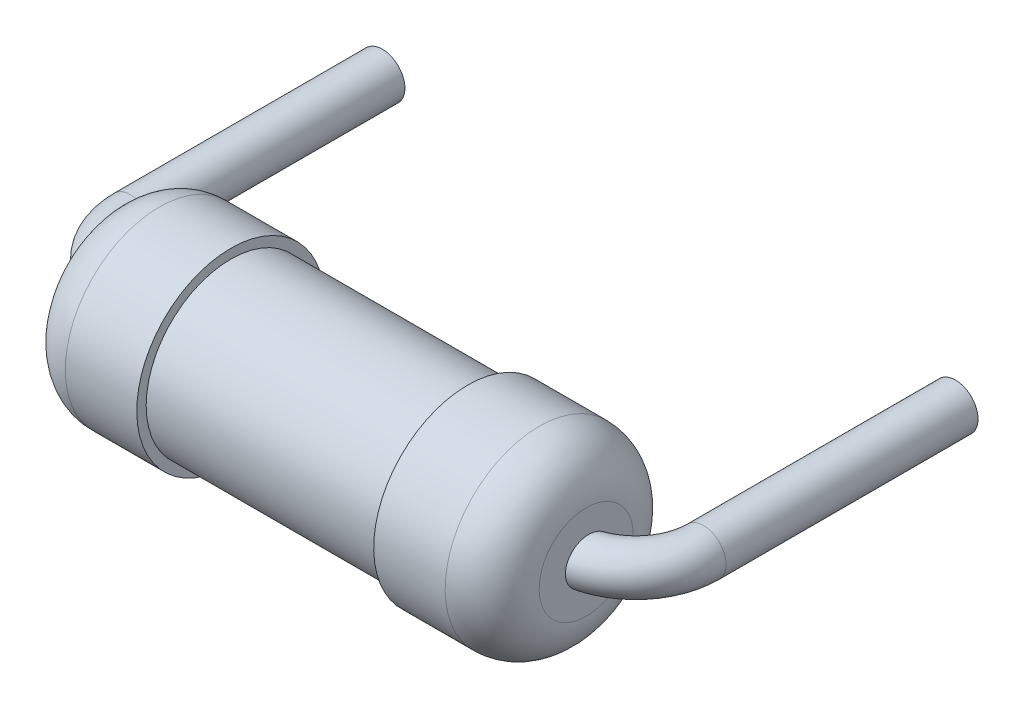
ISO-10303-21;
HEADER;
FILE_DESCRIPTION(('STEP AP214'),'2;1');
FILE_NAME('part.step','',(''),(''),'','','');
FILE_SCHEMA(('AUTOMOTIVE_DESIGN { 1 0 10303 214 1 1 1 1 }'));
ENDSEC;
DATA;
#1=APPLICATION_CONTEXT('core data for automotive mechanical design processes');
#2=APPLICATION_PROTOCOL_DEFINITION('international standard','automotive_design',2000,#1);
#3=PRODUCT_CONTEXT('',#1,'mechanical');
#4=PRODUCT('Part','Part','',(#3));
#5=PRODUCT_RELATED_PRODUCT_CATEGORY('part','',(#4));
#6=PRODUCT_DEFINITION_FORMATION('','',#4);
#7=PRODUCT_DEFINITION_CONTEXT('part definition',#1,'design');
#8=PRODUCT_DEFINITION('design','',#6,#7);
#9=PRODUCT_DEFINITION_SHAPE('','',#8);
#10=(LENGTH_UNIT() NAMED_UNIT(*) SI_UNIT(.MILLI.,.METRE.));
#11=(NAMED_UNIT(*) PLANE_ANGLE_UNIT() SI_UNIT($,.RADIAN.));
#12=(NAMED_UNIT(*) SI_UNIT($,.STERADIAN.) SOLID_ANGLE_UNIT());
#13=UNCERTAINTY_MEASURE_WITH_UNIT(LENGTH_MEASURE(1.E-05),#10,'distance_accuracy_value','');
#14=(GEOMETRIC_REPRESENTATION_CONTEXT(3) GLOBAL_UNCERTAINTY_ASSIGNED_CONTEXT((#13)) GLOBAL_UNIT_ASSIGNED_CONTEXT((#10,
#11,#12)) REPRESENTATION_CONTEXT('',''));
#15=CARTESIAN_POINT('',(0.,0.,0.));
#16=DIRECTION('',(0.,0.,1.));
#17=DIRECTION('',(1.,0.,0.));
#18=AXIS2_PLACEMENT_3D('',#15,#16,#17);
#19=CARTESIAN_POINT('',(7.32,0.,-3.));
#20=DIRECTION('',(0.,0.,1.));
#21=DIRECTION('',(1.,0.,0.));
#22=AXIS2_PLACEMENT_3D('',#19,#20,#21);
#23=PLANE('',#22);
#24=CARTESIAN_POINT('',(7.62,0.,-3.));
#25=DIRECTION('',(0.,0.,-1.));
#26=DIRECTION('',(-1.,0.,0.));
#27=AXIS2_PLACEMENT_3D('',#24,#25,#26);
#28=CIRCLE('',#27,0.3);
#29=CARTESIAN_POINT('',(7.32,0.,-3.));
#30=VERTEX_POINT('',#29);
#31=EDGE_CURVE('E11',#30,#30,#28,.T.);
#32=ORIENTED_EDGE('',*,*,#31,.T.);
#33=EDGE_LOOP('',(#32));
#34=FACE_BOUND('',#33,.T.);
#35=ADVANCED_FACE('F17',(#34),#23,.F.);
#36=CARTESIAN_POINT('',(7.62,0.,0.35));
#37=DIRECTION('',(0.,0.,-1.));
#38=DIRECTION('',(-1.,0.,0.));
#39=AXIS2_PLACEMENT_3D('',#36,#37,#38);
#40=CYLINDRICAL_SURFACE('',#39,0.3);
#41=DIRECTION('',(0.,0.,-1.));
#42=VECTOR('',#41,1.);
#43=CARTESIAN_POINT('',(7.32,0.,0.35));
#44=LINE('',#43,#42);
#45=CARTESIAN_POINT('',(7.32,0.,0.35));
#46=VERTEX_POINT('',#45);
#47=EDGE_CURVE('E25',#46,#30,#44,.T.);
#48=ORIENTED_EDGE('',*,*,#47,.T.);
#49=ORIENTED_EDGE('',*,*,#31,.F.);
#50=ORIENTED_EDGE('',*,*,#47,.F.);
#51=CARTESIAN_POINT('',(7.62,0.,0.35));
#52=DIRECTION('',(0.,0.,1.));
#53=DIRECTION('',(1.,0.,0.));
#54=AXIS2_PLACEMENT_3D('',#51,#52,#53);
#55=CIRCLE('',#54,0.3);
#56=EDGE_CURVE('E157',#46,#46,#55,.T.);
#57=ORIENTED_EDGE('',*,*,#56,.F.);
#58=EDGE_LOOP('',(#48,#49,#50,#57));
#59=FACE_BOUND('',#58,.T.);
#60=ADVANCED_FACE('F161',(#59),#40,.T.);
#61=CARTESIAN_POINT('',(6.72,0.,0.35));
#62=DIRECTION('',(0.,1.,0.));
#63=DIRECTION('',(0.,0.,1.));
#64=AXIS2_PLACEMENT_3D('',#61,#62,#63);
#65=TOROIDAL_SURFACE('',#64,0.9,0.3);
#66=CARTESIAN_POINT('',(6.96,0.,0.899909083395));
#67=CARTESIAN_POINT('',(6.96,-0.009860167462582,0.89990896861));
#68=CARTESIAN_POINT('',(6.96,-0.0196044152314,0.900333777569));
#69=CARTESIAN_POINT('',(6.96,-0.02906856746895,0.901162791225));
#70=CARTESIAN_POINT('',(6.96,-0.03818494668051,0.902337445313));
#71=CARTESIAN_POINT('',(6.96,-0.04697397432956,0.903804960014));
#72=CARTESIAN_POINT('',(6.96,-0.0654122858756,0.907588661461));
#73=CARTESIAN_POINT('',(6.96,-0.07491985816654,0.909985989386));
#74=CARTESIAN_POINT('',(6.96,-0.08408849098391,0.912709553602));
#75=CARTESIAN_POINT('',(6.96,-0.09294310465939,0.915726321464));
#76=CARTESIAN_POINT('',(6.96,-0.10150496885,0.919011549987));
#77=CARTESIAN_POINT('',(6.96,-0.118958221281,0.926453836747));
#78=CARTESIAN_POINT('',(6.96,-0.127787715696,0.930666010737));
#79=CARTESIAN_POINT('',(6.96,-0.136306161655,0.935155928941));
#80=CARTESIAN_POINT('',(6.96,-0.144532121634,0.939904049757));
#81=CARTESIAN_POINT('',(6.96,-0.152479877126,0.944895641374));
#82=CARTESIAN_POINT('',(6.96,-0.168328600516,0.955672815412));
#83=CARTESIAN_POINT('',(6.96,-0.176194773963,0.961488214941));
#84=CARTESIAN_POINT('',(6.96,-0.183772608747,0.967551566344));
#85=CARTESIAN_POINT('',(6.96,-0.191071765541,0.973851742068));
#86=CARTESIAN_POINT('',(6.96,-0.198098606692,0.980379951052));
#87=CARTESIAN_POINT('',(6.96,-0.211800202804,0.994065659178));
#88=CARTESIAN_POINT('',(6.96,-0.218460270558,1.001234983766));
#89=CARTESIAN_POINT('',(6.96,-0.224839910615,1.00863041136));
#90=CARTESIAN_POINT('',(6.96,-0.230940211566,1.016245364777));
#91=CARTESIAN_POINT('',(6.96,-0.236759839456,1.024073990789));
#92=CARTESIAN_POINT('',(6.96,-0.247832003876,1.040150861324));
#93=CARTESIAN_POINT('',(6.96,-0.253084568675,1.048398903269));
#94=CARTESIAN_POINT('',(6.96,-0.258049049185,1.05685004652));
#95=CARTESIAN_POINT('',(6.96,-0.2627200155,1.065498685566));
#96=CARTESIAN_POINT('',(6.96,-0.267090290802,1.074338848812));
#97=CARTESIAN_POINT('',(6.96,-0.275134913375,1.092219064394));
#98=CARTESIAN_POINT('',(6.96,-0.278821000575,1.10125194666));
#99=CARTESIAN_POINT('',(6.96,-0.282200788118,1.110456818481));
#100=CARTESIAN_POINT('',(6.96,-0.285264726102,1.119826534893));
#101=CARTESIAN_POINT('',(6.96,-0.288002139566,1.129352832871));
#102=CARTESIAN_POINT('',(6.96,-0.292725370416,1.148397637921));
#103=CARTESIAN_POINT('',(6.96,-0.29473215882,1.157906911838));
#104=CARTESIAN_POINT('',(6.96,-0.296410834199,1.16754558505));
#105=CARTESIAN_POINT('',(6.96,-0.297750172302,1.177303521997));
#106=CARTESIAN_POINT('',(6.96,-0.298738484134,1.187169019587));
#107=CARTESIAN_POINT('',(6.96,-0.29996489055,1.20670853133));
#108=CARTESIAN_POINT('',(6.96,-0.300230362775,1.216375375657));
#109=CARTESIAN_POINT('',(6.96,-0.300149187552,1.22611747583));
#110=CARTESIAN_POINT('',(6.96,-0.299710732489,1.235921267953));
#111=CARTESIAN_POINT('',(6.96,-0.298904577874,1.245771488577));
#112=CARTESIAN_POINT('',(6.96,-0.296585075031,1.265125180201));
#113=CARTESIAN_POINT('',(6.96,-0.295102319855,1.27462625024));
#114=CARTESIAN_POINT('',(6.96,-0.293263243612,1.284139361954));
#115=CARTESIAN_POINT('',(6.96,-0.29105964956,1.293647958229));
#116=CARTESIAN_POINT('',(6.96,-0.288484151749,1.303133947704));
#117=CARTESIAN_POINT('',(6.96,-0.282698057797,1.321631888118));
#118=CARTESIAN_POINT('',(6.96,-0.279518212828,1.330647292743));
#119=CARTESIAN_POINT('',(6.96,-0.275984865526,1.339606568389));
#120=CARTESIAN_POINT('',(6.96,-0.27209347283,1.348491205415));
#121=CARTESIAN_POINT('',(6.96,-0.26784072321,1.357281534804));
#122=CARTESIAN_POINT('',(6.96,-0.258792456003,1.374285939199));
#123=CARTESIAN_POINT('',(6.96,-0.254025471274,1.382509099941));
#124=CARTESIAN_POINT('',(6.96,-0.248921774536,1.390607746147));
#125=CARTESIAN_POINT('',(6.96,-0.24348099529,1.398562707415));
#126=CARTESIAN_POINT('',(6.96,-0.237704200488,1.406354107177));
#127=CARTESIAN_POINT('',(6.96,-0.225715116467,1.421280374005));
#128=CARTESIAN_POINT('',(6.96,-0.219527700064,1.428429026844));
#129=CARTESIAN_POINT('',(6.96,-0.213033898729,1.435388985848));
#130=CARTESIAN_POINT('',(6.96,-0.206237442407,1.442141620875));
#131=CARTESIAN_POINT('',(6.96,-0.199143537578,1.448668007007));
#132=CARTESIAN_POINT('',(6.96,-0.184639358866,1.461004311837));
#133=CARTESIAN_POINT('',(6.96,-0.177249661366,1.46683162664));
#134=CARTESIAN_POINT('',(6.96,-0.169595743404,1.472413651413));
#135=CARTESIAN_POINT('',(6.96,-0.161685063001,1.477733185029));
#136=CARTESIAN_POINT('',(6.96,-0.153526567552,1.482773042789));
#137=CARTESIAN_POINT('',(6.96,-0.137020377957,1.492097733275));
#138=CARTESIAN_POINT('',(6.96,-0.128688741655,1.496402506097));
#139=CARTESIAN_POINT('',(6.96,-0.120145015698,1.500414870926));
#140=CARTESIAN_POINT('',(6.96,-0.111400273136,1.504119613979));
#141=CARTESIAN_POINT('',(6.96,-0.102467429294,1.507501811642));
#142=CARTESIAN_POINT('',(6.96,-0.08453487359643,1.513498183633));
#143=CARTESIAN_POINT('',(6.96,-0.07554644720911,1.51613308184));
#144=CARTESIAN_POINT('',(6.96,-0.06640854708582,1.518437839156));
#145=CARTESIAN_POINT('',(6.96,-0.05713780068804,1.520399910874));
#146=CARTESIAN_POINT('',(6.96,-0.04775487845774,1.522007893513));
#147=CARTESIAN_POINT('',(6.96,-0.02969292548283,1.52437977876));
#148=CARTESIAN_POINT('',(6.96,-0.02102889094976,1.525208924822));
#149=CARTESIAN_POINT('',(6.96,-0.01231404153143,1.525730890851));
#150=CARTESIAN_POINT('',(6.96,-0.003572679276074,1.525941220805));
#151=CARTESIAN_POINT('',(6.96,0.005168243033088,1.52583907475));
#152=CARTESIAN_POINT('',(6.96,0.02337844678287,1.524978413229));
#153=CARTESIAN_POINT('',(6.96,0.03284373024997,1.524160868463));
#154=CARTESIAN_POINT('',(6.96,0.04224172239025,1.522980299422));
#155=CARTESIAN_POINT('',(6.96,0.05154503802108,1.521444853212));
#156=CARTESIAN_POINT('',(6.96,0.06073215666605,1.519565119195));
#157=CARTESIAN_POINT('',(6.96,0.07909771199475,1.515080715405));
#158=CARTESIAN_POINT('',(6.96,0.0882675531125,1.512456387335));
#159=CARTESIAN_POINT('',(6.96,0.09727920151967,1.509494357792));
#160=CARTESIAN_POINT('',(6.96,0.106117302403,1.506208331254));
#161=CARTESIAN_POINT('',(6.96,0.114768890523,1.502612503667));
#162=CARTESIAN_POINT('',(6.96,0.1319661163,1.494697932395));
#163=CARTESIAN_POINT('',(6.96,0.140497712216,1.490358583428));
#164=CARTESIAN_POINT('',(6.96,0.148806071355,1.485719654426));
#165=CARTESIAN_POINT('',(6.96,0.156880646133,1.480797412311));
#166=CARTESIAN_POINT('',(6.96,0.164712447986,1.475608252032));
#167=CARTESIAN_POINT('',(6.96,0.180151425777,1.46453127229));
#168=CARTESIAN_POINT('',(6.96,0.187739967164,1.45862481836));
#169=CARTESIAN_POINT('',(6.96,0.195051332691,1.452467727028));
#170=CARTESIAN_POINT('',(6.96,0.20207865613,1.446078243141));
#171=CARTESIAN_POINT('',(6.96,0.208816543867,1.439474464151));
#172=CARTESIAN_POINT('',(6.96,0.221953238059,1.425612923524));
#173=CARTESIAN_POINT('',(6.96,0.228328994524,1.418339683896));
#174=CARTESIAN_POINT('',(6.96,0.234383964852,1.410874723556));
#175=CARTESIAN_POINT('',(6.96,0.240115238483,1.403237627432));
#176=CARTESIAN_POINT('',(6.96,0.245521373748,1.395447463058));
#177=CARTESIAN_POINT('',(6.96,0.25588986733,1.379276120213));
#178=CARTESIAN_POINT('',(6.96,0.260825161615,1.370883687614));
#179=CARTESIAN_POINT('',(6.96,0.265408347201,1.362366366749));
#180=CARTESIAN_POINT('',(6.96,0.269640836772,1.353744077057));
#181=CARTESIAN_POINT('',(6.96,0.273525389215,1.345035773446));
#182=CARTESIAN_POINT('',(6.96,0.280757370989,1.327109983642));
#183=CARTESIAN_POINT('',(6.96,0.284074778857,1.317886520225));
#184=CARTESIAN_POINT('',(6.96,0.28702301626,1.308609389122));
#185=CARTESIAN_POINT('',(6.96,0.289607785113,1.29929753334));
#186=CARTESIAN_POINT('',(6.96,0.291835806202,1.289968505808));
#187=CARTESIAN_POINT('',(6.96,0.295674983107,1.270905490066));
#188=CARTESIAN_POINT('',(6.96,0.297255138129,1.261171409814));
#189=CARTESIAN_POINT('',(6.96,0.298464076807,1.251454505978));
#190=CARTESIAN_POINT('',(6.96,0.299311079865,1.241771395371));
#191=CARTESIAN_POINT('',(6.96,0.299805916194,1.232137034265));
#192=CARTESIAN_POINT('',(6.96,0.300118111197,1.212595339038));
#193=CARTESIAN_POINT('',(6.96,0.299906304864,1.202693342182));
#194=CARTESIAN_POINT('',(6.96,0.299334986276,1.192873677979));
#195=CARTESIAN_POINT('',(6.96,0.298415549391,1.183149632812));
#196=CARTESIAN_POINT('',(6.96,0.29715921972,1.173532829284));
#197=CARTESIAN_POINT('',(6.96,0.293937801394,1.154190874));
#198=CARTESIAN_POINT('',(6.96,0.291948588365,1.144474495238));
#199=CARTESIAN_POINT('',(6.96,0.28962167445,1.134895115228));
#200=CARTESIAN_POINT('',(6.96,0.286968474246,1.125462408515));
#201=CARTESIAN_POINT('',(6.96,0.283999557728,1.116184698885));
#202=CARTESIAN_POINT('',(6.96,0.277365720041,1.097719338125));
#203=CARTESIAN_POINT('',(6.96,0.273684735103,1.088540329457));
#204=CARTESIAN_POINT('',(6.96,0.269692170683,1.079539418357));
#205=CARTESIAN_POINT('',(6.96,0.265397023465,1.070723360764));
#206=CARTESIAN_POINT('',(6.96,0.260806811571,1.062098183552));
#207=CARTESIAN_POINT('',(6.96,0.251004219697,1.045163947022));
#208=CARTESIAN_POINT('',(6.96,0.245786411547,1.036858741787));
#209=CARTESIAN_POINT('',(6.96,0.240280395782,1.028758943151));
#210=CARTESIAN_POINT('',(6.96,0.234490304979,1.02087012779));
#211=CARTESIAN_POINT('',(6.96,0.22841815861,1.013198074729));
#212=CARTESIAN_POINT('',(6.96,0.215801547815,0.998407234883));
#213=CARTESIAN_POINT('',(6.96,0.209264913083,0.99128247471));
#214=CARTESIAN_POINT('',(6.96,0.202454000094,0.984380026053));
#215=CARTESIAN_POINT('',(6.96,0.195365961507,0.977706983911));
#216=CARTESIAN_POINT('',(6.96,0.187995061392,0.971271997058));
#217=CARTESIAN_POINT('',(6.96,0.173012837564,0.959175029375));
#218=CARTESIAN_POINT('',(6.96,0.165426529007,0.953492099376));
#219=CARTESIAN_POINT('',(6.96,0.157566437944,0.948044934321));
#220=CARTESIAN_POINT('',(6.96,0.149421373308,0.942845601948));
#221=CARTESIAN_POINT('',(6.96,0.140976264593,0.937909781461));
#222=CARTESIAN_POINT('',(6.96,0.124148131162,0.928975627958));
#223=CARTESIAN_POINT('',(6.96,0.115814071992,0.924934439518));
#224=CARTESIAN_POINT('',(6.96,0.107194037794,0.921149181784));
#225=CARTESIAN_POINT('',(6.96,0.09826937450524,0.917639774974));
#226=CARTESIAN_POINT('',(6.96,0.08901696421491,0.914432828225));
#227=CARTESIAN_POINT('',(6.96,0.06762356037127,0.908046964389));
#228=CARTESIAN_POINT('',(6.96,0.05540377745077,0.905068595899));
#229=CARTESIAN_POINT('',(6.96,0.04253681255711,0.902629529668));
#230=CARTESIAN_POINT('',(6.96,0.02893994360873,0.900849442899));
#231=CARTESIAN_POINT('',(6.96,0.0146772221458,0.899909046356));
#232=CARTESIAN_POINT('',(6.96,0.,0.899909083395));
#233=(BOUNDED_CURVE() B_SPLINE_CURVE(6,(#66,#67,#68,#69,#70,#71,#72,#73,#74,#75,#76,#77,#78,#79,
#80,#81,#82,#83,#84,#85,#86,#87,#88,#89,#90,#91,#92,#93,#94,#95,#96,#97,#98,#99,#100,#101,#102,
#103,#104,#105,#106,#107,#108,#109,#110,#111,#112,#113,#114,#115,#116,#117,#118,#119,#120,#121,
#122,#123,#124,#125,#126,#127,#128,#129,#130,#131,#132,#133,#134,#135,#136,#137,#138,#139,#140,
#141,#142,#143,#144,#145,#146,#147,#148,#149,#150,#151,#152,#153,#154,#155,#156,#157,#158,#159,
#160,#161,#162,#163,#164,#165,#166,#167,#168,#169,#170,#171,#172,#173,#174,#175,#176,#177,#178,
#179,#180,#181,#182,#183,#184,#185,#186,#187,#188,#189,#190,#191,#192,#193,#194,#195,#196,#197,
#198,#199,#200,#201,#202,#203,#204,#205,#206,#207,#208,#209,#210,#211,#212,#213,#214,#215,#216,
#217,#218,#219,#220,#221,#222,#223,#224,#225,#226,#227,#228,#229,#230,#231,#232),.UNSPECIFIED.,
.T.,.F.) B_SPLINE_CURVE_WITH_KNOTS((7,5,5,5,5,5,5,5,5,5,5,5,5,5,5,5,5,5,5,5,5,5,5,5,5,5,5,5,5,5,
5,5,5,7),(0.,0.02522151735631,0.05431626764274,0.08648932873413,0.120698905604,0.15585219498,
0.191016701755,0.225517033144,0.258939642143,0.291086884381,0.32191412294,0.351469698498,
0.379846555914,0.407148198058,0.433469525493,0.458895614127,0.483540398702,0.505898369155,
0.530279933853,0.555348100008,0.581270886766,0.608136607836,0.636034631737,0.665066137875,
0.695331933304,0.726904811218,0.759787311372,0.793856187529,0.828799116201,0.864057997078,
0.898806507422,0.932001552493,0.962545077037,1.),
.UNSPECIFIED.) CURVE() GEOMETRIC_REPRESENTATION_ITEM() RATIONAL_B_SPLINE_CURVE((1.,1.,1.,1.,1.,
1.,1.,1.,1.,1.,1.,1.,1.,1.,1.,1.,1.,1.,1.,1.,1.,1.,1.,1.,1.,1.,1.,1.,1.,1.,1.,1.,1.,1.,1.,1.,1.,
1.,1.,1.,1.,1.,1.,1.,1.,1.,1.,1.,1.,1.,1.,1.,1.,1.,1.,1.,1.,1.,1.,1.,1.,1.,1.,1.,1.,1.,1.,1.,1.,
1.,1.,1.,1.,1.,1.,1.,1.,1.,1.,1.,1.,1.,1.,1.,1.,1.,1.,1.,1.,1.,1.,1.,1.,1.,1.,1.,1.,1.,1.,1.,1.,
1.,1.,1.,1.,1.,1.,1.,1.,1.,1.,1.,1.,1.,1.,1.,1.,1.,1.,1.,1.,1.,1.,1.,1.,1.,1.,1.,1.,1.,1.,1.,1.,
1.,1.,1.,1.,1.,1.,1.,1.,1.,1.,1.,1.,1.,1.,1.,1.,1.,1.,1.,1.,1.,1.,1.,1.,1.,1.,1.,1.,1.,1.,1.,1.,
1.,1.)) REPRESENTATION_ITEM(''));
#234=CARTESIAN_POINT('',(6.96,0.,0.899909083395));
#235=VERTEX_POINT('',#234);
#236=EDGE_CURVE('E129',#235,#235,#233,.T.);
#237=ORIENTED_EDGE('',*,*,#236,.F.);
#238=CARTESIAN_POINT('',(6.72,0.,0.35));
#239=DIRECTION('',(0.,1.,0.));
#240=DIRECTION('',(0.,0.,1.));
#241=AXIS2_PLACEMENT_3D('',#238,#239,#240);
#242=CIRCLE('',#241,0.6);
#243=EDGE_CURVE('E150',#235,#46,#242,.T.);
#244=ORIENTED_EDGE('',*,*,#243,.T.);
#245=ORIENTED_EDGE('',*,*,#56,.T.);
#246=ORIENTED_EDGE('',*,*,#243,.F.);
#247=EDGE_LOOP('',(#237,#244,#245,#246));
#248=FACE_BOUND('',#247,.T.);
#249=ADVANCED_FACE('F164',(#248),#65,.T.);
#250=CARTESIAN_POINT('',(6.96,1.25,1.25));
#251=DIRECTION('',(-1.,0.,0.));
#252=DIRECTION('',(0.,0.,1.));
#253=AXIS2_PLACEMENT_3D('',#250,#251,#252);
#254=PLANE('',#253);
#255=ORIENTED_EDGE('',*,*,#236,.T.);
#256=EDGE_LOOP('',(#255));
#257=FACE_BOUND('',#256,.T.);
#258=CARTESIAN_POINT('',(6.96,0.,1.25));
#259=DIRECTION('',(1.,0.,0.));
#260=DIRECTION('',(0.,1.,0.));
#261=AXIS2_PLACEMENT_3D('',#258,#259,#260);
#262=CIRCLE('',#261,0.625);
#263=CARTESIAN_POINT('',(6.96,0.625,1.25));
#264=VERTEX_POINT('',#263);
#265=EDGE_CURVE('E124',#264,#264,#262,.T.);
#266=ORIENTED_EDGE('',*,*,#265,.T.);
#267=EDGE_LOOP('',(#266));
#268=FACE_BOUND('',#267,.T.);
#269=ADVANCED_FACE('F166',(#257,#268),#254,.F.);
#270=CARTESIAN_POINT('',(6.335,0.,1.25));
#271=DIRECTION('',(1.,0.,0.));
#272=DIRECTION('',(0.,1.,0.));
#273=AXIS2_PLACEMENT_3D('',#270,#271,#272);
#274=DEGENERATE_TOROIDAL_SURFACE('',#273,0.625,0.625,.T.);
#275=CARTESIAN_POINT('',(6.335,0.625,1.25));
#276=DIRECTION('',(0.,0.,-1.));
#277=DIRECTION('',(0.,1.,0.));
#278=AXIS2_PLACEMENT_3D('',#275,#276,#277);
#279=CIRCLE('',#278,0.625);
#280=CARTESIAN_POINT('',(6.335,1.25,1.25));
#281=VERTEX_POINT('',#280);
#282=EDGE_CURVE('E130',#281,#264,#279,.T.);
#283=ORIENTED_EDGE('',*,*,#282,.F.);
#284=CARTESIAN_POINT('',(6.335,0.,1.25));
#285=DIRECTION('',(1.,0.,0.));
#286=DIRECTION('',(0.,1.,0.));
#287=AXIS2_PLACEMENT_3D('',#284,#285,#286);
#288=CIRCLE('',#287,1.25);
#289=EDGE_CURVE('E114',#281,#281,#288,.T.);
#290=ORIENTED_EDGE('',*,*,#289,.T.);
#291=ORIENTED_EDGE('',*,*,#282,.T.);
#292=ORIENTED_EDGE('',*,*,#265,.F.);
#293=EDGE_LOOP('',(#283,#290,#291,#292));
#294=FACE_BOUND('',#293,.T.);
#295=ADVANCED_FACE('F169',(#294),#274,.T.);
#296=CARTESIAN_POINT('',(0.3,0.,-3.));
#297=DIRECTION('',(0.,0.,-1.));
#298=DIRECTION('',(0.,-1.,0.));
#299=AXIS2_PLACEMENT_3D('',#296,#297,#298);
#300=PLANE('',#299);
#301=CARTESIAN_POINT('',(0.,0.,-3.));
#302=DIRECTION('',(0.,0.,1.));
#303=DIRECTION('',(1.,0.,0.));
#304=AXIS2_PLACEMENT_3D('',#301,#302,#303);
#305=CIRCLE('',#304,0.3);
#306=CARTESIAN_POINT('',(0.3,0.,-3.));
#307=VERTEX_POINT('',#306);
#308=EDGE_CURVE('E138',#307,#307,#305,.T.);
#309=ORIENTED_EDGE('',*,*,#308,.F.);
#310=EDGE_LOOP('',(#309));
#311=FACE_BOUND('',#310,.T.);
#312=ADVANCED_FACE('F231',(#311),#300,.T.);
#313=CARTESIAN_POINT('',(5.385,0.,1.25));
#314=DIRECTION('',(-1.,0.,0.));
#315=DIRECTION('',(0.,1.,0.));
#316=AXIS2_PLACEMENT_3D('',#313,#314,#315);
#317=CYLINDRICAL_SURFACE('',#316,1.25);
#318=CARTESIAN_POINT('',(5.385,0.,1.25));
#319=DIRECTION('',(1.,0.,0.));
#320=DIRECTION('',(0.,1.,0.));
#321=AXIS2_PLACEMENT_3D('',#318,#319,#320);
#322=CIRCLE('',#321,1.25);
#323=CARTESIAN_POINT('',(5.385,1.25,1.25));
#324=VERTEX_POINT('',#323);
#325=EDGE_CURVE('E134',#324,#324,#322,.T.);
#326=ORIENTED_EDGE('',*,*,#325,.T.);
#327=DIRECTION('',(1.,0.,0.));
#328=VECTOR('',#327,1.);
#329=CARTESIAN_POINT('',(5.385,1.25,1.25));
#330=LINE('',#329,#328);
#331=EDGE_CURVE('E141',#324,#281,#330,.T.);
#332=ORIENTED_EDGE('',*,*,#331,.T.);
#333=ORIENTED_EDGE('',*,*,#289,.F.);
#334=ORIENTED_EDGE('',*,*,#331,.F.);
#335=EDGE_LOOP('',(#326,#332,#333,#334));
#336=FACE_BOUND('',#335,.T.);
#337=ADVANCED_FACE('F227',(#336),#317,.T.);
#338=CARTESIAN_POINT('',(0.,0.,-3.));
#339=DIRECTION('',(0.,0.,1.));
#340=DIRECTION('',(1.,0.,0.));
#341=AXIS2_PLACEMENT_3D('',#338,#339,#340);
#342=CYLINDRICAL_SURFACE('',#341,0.3);
#343=DIRECTION('',(0.,0.,1.));
#344=VECTOR('',#343,1.);
#345=CARTESIAN_POINT('',(0.3,0.,-3.));
#346=LINE('',#345,#344);
#347=CARTESIAN_POINT('',(0.3,0.,0.35));
#348=VERTEX_POINT('',#347);
#349=EDGE_CURVE('E135',#307,#348,#346,.T.);
#350=ORIENTED_EDGE('',*,*,#349,.T.);
#351=CARTESIAN_POINT('',(0.,0.,0.35));
#352=DIRECTION('',(0.,0.,1.));
#353=DIRECTION('',(1.,0.,0.));
#354=AXIS2_PLACEMENT_3D('',#351,#352,#353);
#355=CIRCLE('',#354,0.3);
#356=EDGE_CURVE('E100',#348,#348,#355,.T.);
#357=ORIENTED_EDGE('',*,*,#356,.F.);
#358=ORIENTED_EDGE('',*,*,#349,.F.);
#359=ORIENTED_EDGE('',*,*,#308,.T.);
#360=EDGE_LOOP('',(#350,#357,#358,#359));
#361=FACE_BOUND('',#360,.T.);
#362=ADVANCED_FACE('F230',(#361),#342,.T.);
#363=CARTESIAN_POINT('',(5.385,1.25,1.25));
#364=DIRECTION('',(-1.,0.,0.));
#365=DIRECTION('',(0.,0.,1.));
#366=AXIS2_PLACEMENT_3D('',#363,#364,#365);
#367=PLANE('',#366);
#368=CARTESIAN_POINT('',(5.385,0.,1.25));
#369=DIRECTION('',(-1.,0.,0.));
#370=DIRECTION('',(0.,1.,0.));
#371=AXIS2_PLACEMENT_3D('',#368,#369,#370);
#372=CIRCLE('',#371,1.125);
#373=CARTESIAN_POINT('',(5.385,1.125,1.25));
#374=VERTEX_POINT('',#373);
#375=EDGE_CURVE('E96',#374,#374,#372,.T.);
#376=ORIENTED_EDGE('',*,*,#375,.F.);
#377=EDGE_LOOP('',(#376));
#378=FACE_BOUND('',#377,.T.);
#379=ORIENTED_EDGE('',*,*,#325,.F.);
#380=EDGE_LOOP('',(#379));
#381=FACE_BOUND('',#380,.T.);
#382=ADVANCED_FACE('F259',(#378,#381),#367,.T.);
#383=CARTESIAN_POINT('',(0.9,0.,0.35));
#384=DIRECTION('',(0.,1.,0.));
#385=DIRECTION('',(-1.,0.,0.));
#386=AXIS2_PLACEMENT_3D('',#383,#384,#385);
#387=TOROIDAL_SURFACE('',#386,0.9,0.3);
#388=ORIENTED_EDGE('',*,*,#356,.T.);
#389=CARTESIAN_POINT('',(0.9,0.,0.35));
#390=DIRECTION('',(0.,1.,0.));
#391=DIRECTION('',(-1.,0.,0.));
#392=AXIS2_PLACEMENT_3D('',#389,#390,#391);
#393=CIRCLE('',#392,0.6);
#394=CARTESIAN_POINT('',(0.66,0.,0.899909083395));
#395=VERTEX_POINT('',#394);
#396=EDGE_CURVE('E107',#348,#395,#393,.T.);
#397=ORIENTED_EDGE('',*,*,#396,.T.);
#398=CARTESIAN_POINT('',(0.66,0.,0.899909083395));
#399=CARTESIAN_POINT('',(0.66,-0.009861963323296,0.899909084471));
#400=CARTESIAN_POINT('',(0.66,-0.01960383099012,0.900333558971));
#401=CARTESIAN_POINT('',(0.66,-0.0290667633729,0.901163095205));
#402=CARTESIAN_POINT('',(0.66,-0.03818473840012,0.902336888075));
#403=CARTESIAN_POINT('',(0.66,-0.04697555886318,0.903805406252));
#404=CARTESIAN_POINT('',(0.66,-0.06541217845247,0.907588617289));
#405=CARTESIAN_POINT('',(0.66,-0.07491989955217,0.909985996381));
#406=CARTESIAN_POINT('',(0.66,-0.08408858685729,0.912709602459));
#407=CARTESIAN_POINT('',(0.66,-0.0929431150905,0.915726339128));
#408=CARTESIAN_POINT('',(0.66,-0.101504886237,0.919011492948));
#409=CARTESIAN_POINT('',(0.66,-0.118958160976,0.926453793498));
#410=CARTESIAN_POINT('',(0.66,-0.127787740677,0.930666021227));
#411=CARTESIAN_POINT('',(0.66,-0.136306213845,0.935155972835));
#412=CARTESIAN_POINT('',(0.66,-0.144532125259,0.939904061777));
#413=CARTESIAN_POINT('',(0.66,-0.152479834979,0.944895594586));
#414=CARTESIAN_POINT('',(0.66,-0.168328675181,0.955672717204));
#415=CARTESIAN_POINT('',(0.66,-0.176194628708,0.961488338811));
#416=CARTESIAN_POINT('',(0.66,-0.183772627725,0.967551590964));
#417=CARTESIAN_POINT('',(0.66,-0.191071921446,0.973851630909));
#418=CARTESIAN_POINT('',(0.66,-0.19809849539,0.980379998969));
#419=CARTESIAN_POINT('',(0.66,-0.211800252103,0.99406561399));
#420=CARTESIAN_POINT('',(0.66,-0.218460183619,1.001235038361));
#421=CARTESIAN_POINT('',(0.66,-0.224839916669,1.008630424477));
#422=CARTESIAN_POINT('',(0.66,-0.230940302033,1.016245317007));
#423=CARTESIAN_POINT('',(0.66,-0.236759778797,1.024074009311));
#424=CARTESIAN_POINT('',(0.66,-0.247832030244,1.040150827903));
#425=CARTESIAN_POINT('',(0.66,-0.253084597548,1.048398894868));
#426=CARTESIAN_POINT('',(0.66,-0.258049056373,1.056850063306));
#427=CARTESIAN_POINT('',(0.66,-0.262719990238,1.065498702059));
#428=CARTESIAN_POINT('',(0.66,-0.267090249501,1.07433884651));
#429=CARTESIAN_POINT('',(0.66,-0.275134936213,1.092219038761));
#430=CARTESIAN_POINT('',(0.66,-0.278821023102,1.101251941956));
#431=CARTESIAN_POINT('',(0.66,-0.282200792082,1.110456832947));
#432=CARTESIAN_POINT('',(0.66,-0.285264705632,1.119826546568));
#433=CARTESIAN_POINT('',(0.66,-0.288002108658,1.129352827713));
#434=CARTESIAN_POINT('',(0.66,-0.29272539517,1.148397615962));
#435=CARTESIAN_POINT('',(0.66,-0.29473218058,1.157906910826));
#436=CARTESIAN_POINT('',(0.66,-0.296410836061,1.167545600214));
#437=CARTESIAN_POINT('',(0.66,-0.297750151594,1.177303530334));
#438=CARTESIAN_POINT('',(0.66,-0.298738455802,1.187169009313));
#439=CARTESIAN_POINT('',(0.66,-0.299964918417,1.206708514181));
#440=CARTESIAN_POINT('',(0.66,-0.300230384291,1.216375379318));
#441=CARTESIAN_POINT('',(0.66,-0.300149186912,1.226117491764));
#442=CARTESIAN_POINT('',(0.66,-0.299710710819,1.235921272022));
#443=CARTESIAN_POINT('',(0.66,-0.298904551758,1.245771471938));
#444=CARTESIAN_POINT('',(0.66,-0.296585103724,1.265125169703));
#445=CARTESIAN_POINT('',(0.66,-0.295102339165,1.274626258325));
#446=CARTESIAN_POINT('',(0.66,-0.293263240337,1.284139377081));
#447=CARTESIAN_POINT('',(0.66,-0.291059628806,1.293647957516));
#448=CARTESIAN_POINT('',(0.66,-0.288484130363,1.303133926208));
#449=CARTESIAN_POINT('',(0.66,-0.282698083788,1.321631884472));
#450=CARTESIAN_POINT('',(0.66,-0.279518227914,1.330647303479));
#451=CARTESIAN_POINT('',(0.66,-0.275984860345,1.33960658093));
#452=CARTESIAN_POINT('',(0.66,-0.272093455342,1.348491200819));
#453=CARTESIAN_POINT('',(0.66,-0.267840708483,1.357281511993));
#454=CARTESIAN_POINT('',(0.66,-0.258792476906,1.374285940745));
#455=CARTESIAN_POINT('',(0.66,-0.254025481533,1.382509111114));
#456=CARTESIAN_POINT('',(0.66,-0.248921768643,1.390607755283));
#457=CARTESIAN_POINT('',(0.66,-0.243480982245,1.398562700734));
#458=CARTESIAN_POINT('',(0.66,-0.237704192262,1.406354086406));
#459=CARTESIAN_POINT('',(0.66,-0.22571513259,1.421280378602));
#460=CARTESIAN_POINT('',(0.66,-0.219527706492,1.428429037341));
#461=CARTESIAN_POINT('',(0.66,-0.213033892817,1.435388992124));
#462=CARTESIAN_POINT('',(0.66,-0.206237433156,1.442141613477));
#463=CARTESIAN_POINT('',(0.66,-0.199143534101,1.448667989237));
#464=CARTESIAN_POINT('',(0.66,-0.184639374507,1.46100431938));
#465=CARTESIAN_POINT('',(0.66,-0.177249666015,1.466831638372));
#466=CARTESIAN_POINT('',(0.66,-0.169595736209,1.472413656662));
#467=CARTESIAN_POINT('',(0.66,-0.161685054894,1.477733175901));
#468=CARTESIAN_POINT('',(0.66,-0.153526567249,1.482773024258));
#469=CARTESIAN_POINT('',(0.66,-0.137020407721,1.492097753386));
#470=CARTESIAN_POINT('',(0.66,-0.128688747003,1.496402530856));
#471=CARTESIAN_POINT('',(0.66,-0.12014499879,1.500414878928));
#472=CARTESIAN_POINT('',(0.66,-0.111400259626,1.504119593216));
#473=CARTESIAN_POINT('',(0.66,-0.102467435485,1.507501774849));
#474=CARTESIAN_POINT('',(0.66,-0.08453493192811,1.513498294635));
#475=CARTESIAN_POINT('',(0.66,-0.07554639694304,1.516132890753));
#476=CARTESIAN_POINT('',(0.66,-0.0664085144705,1.518437847791));
#477=CARTESIAN_POINT('',(0.66,-0.05713783351899,1.520400106432));
#478=CARTESIAN_POINT('',(0.66,-0.04775488525608,1.522007764907));
#479=CARTESIAN_POINT('',(0.66,-0.02969295309097,1.524379864025));
#480=CARTESIAN_POINT('',(0.66,-0.02102888075484,1.525208782901));
#481=CARTESIAN_POINT('',(0.66,-0.01231401679426,1.525730893697));
#482=CARTESIAN_POINT('',(0.66,-0.003572675622322,1.525941364018));
#483=CARTESIAN_POINT('',(0.66,0.005168222805428,1.525838983228));
#484=CARTESIAN_POINT('',(0.66,0.02337847467049,1.524978205181));
#485=CARTESIAN_POINT('',(0.66,0.03284375814827,1.524161190409));
#486=CARTESIAN_POINT('',(0.66,0.04224166817951,1.522980309203));
#487=CARTESIAN_POINT('',(0.66,0.05154498116248,1.52144453626));
#488=CARTESIAN_POINT('',(0.66,0.06073223707979,1.519565307122));
#489=CARTESIAN_POINT('',(0.66,0.07909772773064,1.515080653378));
#490=CARTESIAN_POINT('',(0.66,0.08826753248322,1.512456350085));
#491=CARTESIAN_POINT('',(0.66,0.09727917108862,1.509494369221));
#492=CARTESIAN_POINT('',(0.66,0.106117308319,1.506208374239));
#493=CARTESIAN_POINT('',(0.66,0.114768939441,1.502612541932));
#494=CARTESIAN_POINT('',(0.66,0.131966117695,1.494697909774));
#495=CARTESIAN_POINT('',(0.66,0.140497702999,1.490358571609));
#496=CARTESIAN_POINT('',(0.66,0.148806061897,1.485719660214));
#497=CARTESIAN_POINT('',(0.66,0.156880650792,1.480797427009));
#498=CARTESIAN_POINT('',(0.66,0.164712466725,1.47560826256));
#499=CARTESIAN_POINT('',(0.66,0.180151423764,1.464531255078));
#500=CARTESIAN_POINT('',(0.66,0.187739958872,1.458624810593));
#501=CARTESIAN_POINT('',(0.66,0.195051326582,1.452467732556));
#502=CARTESIAN_POINT('',(0.66,0.202078661493,1.446078253645));
#503=CARTESIAN_POINT('',(0.66,0.208816558921,1.439474469779));
#504=CARTESIAN_POINT('',(0.66,0.221953232148,1.425612904145));
#505=CARTESIAN_POINT('',(0.66,0.228328983313,1.41833967682));
#506=CARTESIAN_POINT('',(0.66,0.234383958936,1.410874731309));
#507=CARTESIAN_POINT('',(0.66,0.240115246881,1.403237638329));
#508=CARTESIAN_POINT('',(0.66,0.245521392347,1.395447466144));
#509=CARTESIAN_POINT('',(0.66,0.255889855564,1.379276097975));
#510=CARTESIAN_POINT('',(0.66,0.260825146013,1.370883681886));
#511=CARTESIAN_POINT('',(0.66,0.265408341569,1.362366377835));
#512=CARTESIAN_POINT('',(0.66,0.269640849736,1.353744088225));
#513=CARTESIAN_POINT('',(0.66,0.273525413156,1.345035772328));
#514=CARTESIAN_POINT('',(0.66,0.280757352367,1.327109961101));
#515=CARTESIAN_POINT('',(0.66,0.284074759274,1.317886517643));
#516=CARTESIAN_POINT('',(0.66,0.287023012024,1.308609403309));
#517=CARTESIAN_POINT('',(0.66,0.289607802772,1.299297542852));
#518=CARTESIAN_POINT('',(0.66,0.291835834134,1.289968498384));
#519=CARTESIAN_POINT('',(0.66,0.295674958709,1.270905470981));
#520=CARTESIAN_POINT('',(0.66,0.297255116553,1.261171411794));
#521=CARTESIAN_POINT('',(0.66,0.298464074992,1.251454521799));
#522=CARTESIAN_POINT('',(0.66,0.299311100714,1.241771401083));
#523=CARTESIAN_POINT('',(0.66,0.299805944827,1.232137019844));
#524=CARTESIAN_POINT('',(0.66,0.30011808361,1.212595326012));
#525=CARTESIAN_POINT('',(0.66,0.299906283631,1.202693348802));
#526=CARTESIAN_POINT('',(0.66,0.299334987113,1.192873693594));
#527=CARTESIAN_POINT('',(0.66,0.298415571185,1.183149633751));
#528=CARTESIAN_POINT('',(0.66,0.297159245916,1.173532809156));
#529=CARTESIAN_POINT('',(0.66,0.293937772017,1.154190866917));
#530=CARTESIAN_POINT('',(0.66,0.291948568133,1.144474505513));
#531=CARTESIAN_POINT('',(0.66,0.289621677512,1.134895129825));
#532=CARTESIAN_POINT('',(0.66,0.286968496105,1.125462405282));
#533=CARTESIAN_POINT('',(0.66,0.283999580964,1.116184674916));
#534=CARTESIAN_POINT('',(0.66,0.277365684897,1.097719334783));
#535=CARTESIAN_POINT('',(0.66,0.273684712853,1.08854034335));
#536=CARTESIAN_POINT('',(0.66,0.269692176119,1.079539433524));
#537=CARTESIAN_POINT('',(0.66,0.265397048483,1.07072335418));
#538=CARTESIAN_POINT('',(0.66,0.260806835513,1.062098154612));
#539=CARTESIAN_POINT('',(0.66,0.251004164416,1.045163946312));
#540=CARTESIAN_POINT('',(0.66,0.245786379559,1.036858764173));
#541=CARTESIAN_POINT('',(0.66,0.240280407048,1.028758964174));
#542=CARTESIAN_POINT('',(0.66,0.234490342534,1.020870115558));
#543=CARTESIAN_POINT('',(0.66,0.228418190257,1.013198030747));
#544=CARTESIAN_POINT('',(0.66,0.215801462132,0.998407266407));
#545=CARTESIAN_POINT('',(0.66,0.209265037039,0.991282398269));
#546=CARTESIAN_POINT('',(0.66,0.202454011648,0.98438004474));
#547=CARTESIAN_POINT('',(0.66,0.195365844133,0.977707070031));
#548=CARTESIAN_POINT('',(0.66,0.187995125017,0.971271927442));
#549=CARTESIAN_POINT('',(0.66,0.173012685338,0.959175110633));
#550=CARTESIAN_POINT('',(0.66,0.165426730288,0.953491920673));
#551=CARTESIAN_POINT('',(0.66,0.157566473117,0.948044968651));
#552=CARTESIAN_POINT('',(0.66,0.149421191466,0.9428457983));
#553=CARTESIAN_POINT('',(0.66,0.140976348171,0.937909629891));
#554=CARTESIAN_POINT('',(0.66,0.124148062588,0.928975570166));
#555=CARTESIAN_POINT('',(0.66,0.115814079383,0.924934455913));
#556=CARTESIAN_POINT('',(0.66,0.107194119667,0.921149233675));
#557=CARTESIAN_POINT('',(0.66,0.09826941158436,0.91763978502));
#558=CARTESIAN_POINT('',(0.66,0.08901687105598,0.914432779149));
#559=CARTESIAN_POINT('',(0.66,0.06762842160337,0.908048369916));
#560=CARTESIAN_POINT('',(0.66,0.05540310162877,0.905067930004));
#561=CARTESIAN_POINT('',(0.66,0.04253150709481,0.902628405907));
#562=CARTESIAN_POINT('',(0.66,0.02893757304003,0.900850137762));
#563=CARTESIAN_POINT('',(0.66,0.01468319780375,0.899909084997));
#564=CARTESIAN_POINT('',(0.66,0.,0.899909083395));
#565=(BOUNDED_CURVE() B_SPLINE_CURVE(6,(#398,#399,#400,#401,#402,#403,#404,#405,#406,#407,#408,
#409,#410,#411,#412,#413,#414,#415,#416,#417,#418,#419,#420,#421,#422,#423,#424,#425,#426,#427,
#428,#429,#430,#431,#432,#433,#434,#435,#436,#437,#438,#439,#440,#441,#442,#443,#444,#445,#446,
#447,#448,#449,#450,#451,#452,#453,#454,#455,#456,#457,#458,#459,#460,#461,#462,#463,#464,#465,
#466,#467,#468,#469,#470,#471,#472,#473,#474,#475,#476,#477,#478,#479,#480,#481,#482,#483,#484,
#485,#486,#487,#488,#489,#490,#491,#492,#493,#494,#495,#496,#497,#498,#499,#500,#501,#502,#503,
#504,#505,#506,#507,#508,#509,#510,#511,#512,#513,#514,#515,#516,#517,#518,#519,#520,#521,#522,
#523,#524,#525,#526,#527,#528,#529,#530,#531,#532,#533,#534,#535,#536,#537,#538,#539,#540,#541,
#542,#543,#544,#545,#546,#547,#548,#549,#550,#551,#552,#553,#554,#555,#556,#557,#558,#559,#560,
#561,#562,#563,#564),.UNSPECIFIED.,.T.,.F.) B_SPLINE_CURVE_WITH_KNOTS((7,5,5,5,5,5,5,5,5,5,5,5,
5,5,5,5,5,5,5,5,5,5,5,5,5,5,5,5,5,5,5,5,5,7),(0.,0.02521870323933,0.05431496394384,
0.08648919549843,0.120700162351,0.155854554579,0.191019956077,0.22552099352,0.258944151729,
0.291091798271,0.321919308947,0.351475044446,0.379851974729,0.407153625953,0.43347490921,
0.458900868731,0.483545347382,0.505902822615,0.530283950565,0.555351989471,0.581274789002,
0.608140584187,0.636038742308,0.665070462617,0.695336577837,0.72690990423,0.759792997252,
0.79386262098,0.828806470397,0.864066503475,0.898816439436,0.932013287381,0.962558356523,1.),
.UNSPECIFIED.) CURVE() GEOMETRIC_REPRESENTATION_ITEM() RATIONAL_B_SPLINE_CURVE((1.,1.,1.,1.,1.,
1.,1.,1.,1.,1.,1.,1.,1.,1.,1.,1.,1.,1.,1.,1.,1.,1.,1.,1.,1.,1.,1.,1.,1.,1.,1.,1.,1.,1.,1.,1.,1.,
1.,1.,1.,1.,1.,1.,1.,1.,1.,1.,1.,1.,1.,1.,1.,1.,1.,1.,1.,1.,1.,1.,1.,1.,1.,1.,1.,1.,1.,1.,1.,1.,
1.,1.,1.,1.,1.,1.,1.,1.,1.,1.,1.,1.,1.,1.,1.,1.,1.,1.,1.,1.,1.,1.,1.,1.,1.,1.,1.,1.,1.,1.,1.,1.,
1.,1.,1.,1.,1.,1.,1.,1.,1.,1.,1.,1.,1.,1.,1.,1.,1.,1.,1.,1.,1.,1.,1.,1.,1.,1.,1.,1.,1.,1.,1.,1.,
1.,1.,1.,1.,1.,1.,1.,1.,1.,1.,1.,1.,1.,1.,1.,1.,1.,1.,1.,1.,1.,1.,1.,1.,1.,1.,1.,1.,1.,1.,1.,1.,
1.,1.)) REPRESENTATION_ITEM(''));
#566=EDGE_CURVE('E110',#395,#395,#565,.T.);
#567=ORIENTED_EDGE('',*,*,#566,.T.);
#568=ORIENTED_EDGE('',*,*,#396,.F.);
#569=EDGE_LOOP('',(#388,#397,#567,#568));
#570=FACE_BOUND('',#569,.T.);
#571=ADVANCED_FACE('F211',(#570),#387,.T.);
#572=CARTESIAN_POINT('',(0.66,0.,1.25));
#573=DIRECTION('',(-1.,0.,0.));
#574=DIRECTION('',(0.,1.,0.));
#575=AXIS2_PLACEMENT_3D('',#572,#573,#574);
#576=CYLINDRICAL_SURFACE('',#575,1.125);
#577=ORIENTED_EDGE('',*,*,#375,.T.);
#578=DIRECTION('',(1.,0.,0.));
#579=VECTOR('',#578,1.);
#580=CARTESIAN_POINT('',(0.66,1.125,1.25));
#581=LINE('',#580,#579);
#582=CARTESIAN_POINT('',(2.235,1.125,1.25));
#583=VERTEX_POINT('',#582);
#584=EDGE_CURVE('E93',#583,#374,#581,.T.);
#585=ORIENTED_EDGE('',*,*,#584,.F.);
#586=CARTESIAN_POINT('',(2.235,0.,1.25));
#587=DIRECTION('',(-1.,0.,0.));
#588=DIRECTION('',(0.,1.,0.));
#589=AXIS2_PLACEMENT_3D('',#586,#587,#588);
#590=CIRCLE('',#589,1.125);
#591=EDGE_CURVE('E98',#583,#583,#590,.T.);
#592=ORIENTED_EDGE('',*,*,#591,.F.);
#593=ORIENTED_EDGE('',*,*,#584,.T.);
#594=EDGE_LOOP('',(#577,#585,#592,#593));
#595=FACE_BOUND('',#594,.T.);
#596=ADVANCED_FACE('F94',(#595),#576,.T.);
#597=CARTESIAN_POINT('',(0.66,1.25,1.25));
#598=DIRECTION('',(-1.,0.,0.));
#599=DIRECTION('',(0.,0.,1.));
#600=AXIS2_PLACEMENT_3D('',#597,#598,#599);
#601=PLANE('',#600);
#602=ORIENTED_EDGE('',*,*,#566,.F.);
#603=EDGE_LOOP('',(#602));
#604=FACE_BOUND('',#603,.T.);
#605=CARTESIAN_POINT('',(0.66,0.,1.25));
#606=DIRECTION('',(1.,0.,0.));
#607=DIRECTION('',(0.,1.,0.));
#608=AXIS2_PLACEMENT_3D('',#605,#606,#607);
#609=CIRCLE('',#608,0.625);
#610=CARTESIAN_POINT('',(0.66,0.625,1.25));
#611=VERTEX_POINT('',#610);
#612=EDGE_CURVE('E118',#611,#611,#609,.T.);
#613=ORIENTED_EDGE('',*,*,#612,.F.);
#614=EDGE_LOOP('',(#613));
#615=FACE_BOUND('',#614,.T.);
#616=ADVANCED_FACE('F198',(#604,#615),#601,.T.);
#617=CARTESIAN_POINT('',(2.235,1.25,1.25));
#618=DIRECTION('',(-1.,0.,0.));
#619=DIRECTION('',(0.,0.,1.));
#620=AXIS2_PLACEMENT_3D('',#617,#618,#619);
#621=PLANE('',#620);
#622=ORIENTED_EDGE('',*,*,#591,.T.);
#623=EDGE_LOOP('',(#622));
#624=FACE_BOUND('',#623,.T.);
#625=CARTESIAN_POINT('',(2.235,0.,1.25));
#626=DIRECTION('',(1.,0.,0.));
#627=DIRECTION('',(0.,1.,0.));
#628=AXIS2_PLACEMENT_3D('',#625,#626,#627);
#629=CIRCLE('',#628,1.25);
#630=CARTESIAN_POINT('',(2.235,1.25,1.25));
#631=VERTEX_POINT('',#630);
#632=EDGE_CURVE('E189',#631,#631,#629,.T.);
#633=ORIENTED_EDGE('',*,*,#632,.T.);
#634=EDGE_LOOP('',(#633));
#635=FACE_BOUND('',#634,.T.);
#636=ADVANCED_FACE('F200',(#624,#635),#621,.F.);
#637=CARTESIAN_POINT('',(1.285,0.,1.25));
#638=DIRECTION('',(-1.,0.,0.));
#639=DIRECTION('',(0.,1.,0.));
#640=AXIS2_PLACEMENT_3D('',#637,#638,#639);
#641=DEGENERATE_TOROIDAL_SURFACE('',#640,0.625,0.625,.T.);
#642=ORIENTED_EDGE('',*,*,#612,.T.);
#643=CARTESIAN_POINT('',(1.285,0.625,1.25));
#644=DIRECTION('',(0.,0.,1.));
#645=DIRECTION('',(0.,1.,0.));
#646=AXIS2_PLACEMENT_3D('',#643,#644,#645);
#647=CIRCLE('',#646,0.625);
#648=CARTESIAN_POINT('',(1.285,1.25,1.25));
#649=VERTEX_POINT('',#648);
#650=EDGE_CURVE('E116',#649,#611,#647,.T.);
#651=ORIENTED_EDGE('',*,*,#650,.F.);
#652=CARTESIAN_POINT('',(1.285,0.,1.25));
#653=DIRECTION('',(1.,0.,0.));
#654=DIRECTION('',(0.,1.,0.));
#655=AXIS2_PLACEMENT_3D('',#652,#653,#654);
#656=CIRCLE('',#655,1.25);
#657=EDGE_CURVE('E243',#649,#649,#656,.T.);
#658=ORIENTED_EDGE('',*,*,#657,.F.);
#659=ORIENTED_EDGE('',*,*,#650,.T.);
#660=EDGE_LOOP('',(#642,#651,#658,#659));
#661=FACE_BOUND('',#660,.T.);
#662=ADVANCED_FACE('F194',(#661),#641,.T.);
#663=CARTESIAN_POINT('',(0.66,0.,1.25));
#664=DIRECTION('',(-1.,0.,0.));
#665=DIRECTION('',(0.,1.,0.));
#666=AXIS2_PLACEMENT_3D('',#663,#664,#665);
#667=CYLINDRICAL_SURFACE('',#666,1.25);
#668=ORIENTED_EDGE('',*,*,#657,.T.);
#669=DIRECTION('',(1.,0.,0.));
#670=VECTOR('',#669,1.);
#671=CARTESIAN_POINT('',(0.66,1.25,1.25));
#672=LINE('',#671,#670);
#673=EDGE_CURVE('E187',#649,#631,#672,.T.);
#674=ORIENTED_EDGE('',*,*,#673,.T.);
#675=ORIENTED_EDGE('',*,*,#632,.F.);
#676=ORIENTED_EDGE('',*,*,#673,.F.);
#677=EDGE_LOOP('',(#668,#674,#675,#676));
#678=FACE_BOUND('',#677,.T.);
#679=ADVANCED_FACE('F226',(#678),#667,.T.);
#680=CLOSED_SHELL('',(#35,#60,#249,#269,#295,#312,#337,#362,#382,#571,#596,#616,#636,#662,#679));
#681=MANIFOLD_SOLID_BREP('B1',#680);
#682=ADVANCED_BREP_SHAPE_REPRESENTATION('',(#18,#681),#14);
#683=SHAPE_DEFINITION_REPRESENTATION(#9,#682);
ENDSEC;
END-ISO-10303-21;
